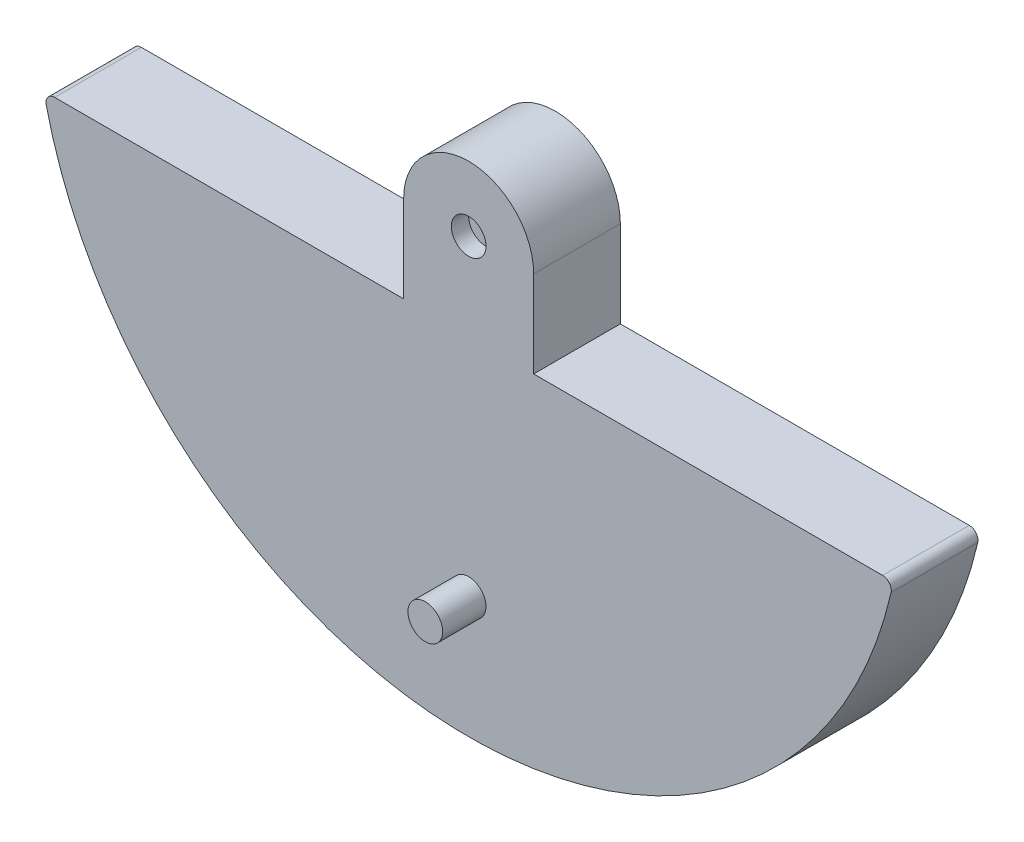
ISO-10303-21;
HEADER;
FILE_DESCRIPTION(('STEP AP214'),'2;1');
FILE_NAME('part.step','',(''),(''),'','','');
FILE_SCHEMA(('AUTOMOTIVE_DESIGN { 1 0 10303 214 1 1 1 1 }'));
ENDSEC;
DATA;
#1=APPLICATION_CONTEXT('core data for automotive mechanical design processes');
#2=APPLICATION_PROTOCOL_DEFINITION('international standard','automotive_design',2000,#1);
#3=PRODUCT_CONTEXT('',#1,'mechanical');
#4=PRODUCT('Part','Part','',(#3));
#5=PRODUCT_RELATED_PRODUCT_CATEGORY('part','',(#4));
#6=PRODUCT_DEFINITION_FORMATION('','',#4);
#7=PRODUCT_DEFINITION_CONTEXT('part definition',#1,'design');
#8=PRODUCT_DEFINITION('design','',#6,#7);
#9=PRODUCT_DEFINITION_SHAPE('','',#8);
#10=(LENGTH_UNIT() NAMED_UNIT(*) SI_UNIT(.MILLI.,.METRE.));
#11=(NAMED_UNIT(*) PLANE_ANGLE_UNIT() SI_UNIT($,.RADIAN.));
#12=(NAMED_UNIT(*) SI_UNIT($,.STERADIAN.) SOLID_ANGLE_UNIT());
#13=UNCERTAINTY_MEASURE_WITH_UNIT(LENGTH_MEASURE(1.E-05),#10,'distance_accuracy_value','');
#14=(GEOMETRIC_REPRESENTATION_CONTEXT(3) GLOBAL_UNCERTAINTY_ASSIGNED_CONTEXT((#13)) GLOBAL_UNIT_ASSIGNED_CONTEXT((#10,
#11,#12)) REPRESENTATION_CONTEXT('',''));
#15=CARTESIAN_POINT('',(0.,0.,0.));
#16=DIRECTION('',(0.,0.,1.));
#17=DIRECTION('',(1.,0.,0.));
#18=AXIS2_PLACEMENT_3D('',#15,#16,#17);
#19=CARTESIAN_POINT('',(0.,-180.,75.));
#20=DIRECTION('',(0.,0.,-1.));
#21=DIRECTION('',(-1.,0.,0.));
#22=AXIS2_PLACEMENT_3D('',#19,#20,#21);
#23=CYLINDRICAL_SURFACE('',#22,10.);
#24=CARTESIAN_POINT('',(0.,-180.,75.));
#25=DIRECTION('',(0.,0.,1.));
#26=DIRECTION('',(1.,0.,0.));
#27=AXIS2_PLACEMENT_3D('',#24,#25,#26);
#28=CIRCLE('',#27,10.);
#29=CARTESIAN_POINT('',(10.,-180.,75.));
#30=VERTEX_POINT('',#29);
#31=EDGE_CURVE('E11',#30,#30,#28,.T.);
#32=ORIENTED_EDGE('',*,*,#31,.F.);
#33=EDGE_LOOP('',(#32));
#34=FACE_BOUND('',#33,.T.);
#35=CARTESIAN_POINT('',(0.,-180.,50.));
#36=DIRECTION('',(0.,0.,1.));
#37=DIRECTION('',(1.,0.,0.));
#38=AXIS2_PLACEMENT_3D('',#35,#36,#37);
#39=CIRCLE('',#38,10.);
#40=CARTESIAN_POINT('',(10.,-180.,50.));
#41=VERTEX_POINT('',#40);
#42=EDGE_CURVE('E44',#41,#41,#39,.T.);
#43=ORIENTED_EDGE('',*,*,#42,.T.);
#44=EDGE_LOOP('',(#43));
#45=FACE_BOUND('',#44,.T.);
#46=ADVANCED_FACE('F41',(#34,#45),#23,.T.);
#47=CARTESIAN_POINT('',(0.,-180.,75.));
#48=DIRECTION('',(0.,0.,1.));
#49=DIRECTION('',(1.,0.,0.));
#50=AXIS2_PLACEMENT_3D('',#47,#48,#49);
#51=PLANE('',#50);
#52=ORIENTED_EDGE('',*,*,#31,.T.);
#53=EDGE_LOOP('',(#52));
#54=FACE_BOUND('',#53,.T.);
#55=ADVANCED_FACE('F56',(#54),#51,.T.);
#56=CARTESIAN_POINT('',(0.,-180.,50.));
#57=DIRECTION('',(0.,0.,1.));
#58=DIRECTION('',(1.,0.,0.));
#59=AXIS2_PLACEMENT_3D('',#56,#57,#58);
#60=PLANE('',#59);
#61=ORIENTED_EDGE('',*,*,#42,.F.);
#62=EDGE_LOOP('',(#61));
#63=FACE_BOUND('',#62,.T.);
#64=ADVANCED_FACE('F54',(#63),#60,.F.);
#65=CLOSED_SHELL('',(#46,#55,#64));
#66=MANIFOLD_SOLID_BREP('B2',#65);
#67=CARTESIAN_POINT('',(0.,0.,50.));
#68=DIRECTION('',(0.,0.,-1.));
#69=DIRECTION('',(-1.,0.,0.));
#70=AXIS2_PLACEMENT_3D('',#67,#68,#69);
#71=CYLINDRICAL_SURFACE('',#70,37.5);
#72=CARTESIAN_POINT('',(0.,0.,0.));
#73=DIRECTION('',(0.,0.,1.));
#74=DIRECTION('',(1.,0.,0.));
#75=AXIS2_PLACEMENT_3D('',#72,#73,#74);
#76=CIRCLE('',#75,37.5);
#77=CARTESIAN_POINT('',(37.5,0.,0.));
#78=VERTEX_POINT('',#77);
#79=CARTESIAN_POINT('',(-37.5,0.,0.));
#80=VERTEX_POINT('',#79);
#81=EDGE_CURVE('E183',#78,#80,#76,.T.);
#82=ORIENTED_EDGE('',*,*,#81,.T.);
#83=DIRECTION('',(0.,0.,-1.));
#84=VECTOR('',#83,1.);
#85=CARTESIAN_POINT('',(-37.5,0.,50.));
#86=LINE('',#85,#84);
#87=CARTESIAN_POINT('',(-37.5,0.,50.));
#88=VERTEX_POINT('',#87);
#89=EDGE_CURVE('E191',#88,#80,#86,.T.);
#90=ORIENTED_EDGE('',*,*,#89,.F.);
#91=CARTESIAN_POINT('',(0.,0.,50.));
#92=DIRECTION('',(0.,0.,1.));
#93=DIRECTION('',(1.,0.,0.));
#94=AXIS2_PLACEMENT_3D('',#91,#92,#93);
#95=CIRCLE('',#94,37.5);
#96=CARTESIAN_POINT('',(37.5,0.,50.));
#97=VERTEX_POINT('',#96);
#98=EDGE_CURVE('E173',#97,#88,#95,.T.);
#99=ORIENTED_EDGE('',*,*,#98,.F.);
#100=DIRECTION('',(0.,0.,-1.));
#101=VECTOR('',#100,1.);
#102=CARTESIAN_POINT('',(37.5,0.,50.));
#103=LINE('',#102,#101);
#104=EDGE_CURVE('E177',#97,#78,#103,.T.);
#105=ORIENTED_EDGE('',*,*,#104,.T.);
#106=EDGE_LOOP('',(#82,#90,#99,#105));
#107=FACE_BOUND('',#106,.T.);
#108=ADVANCED_FACE('F82',(#107),#71,.T.);
#109=CARTESIAN_POINT('',(-37.5,0.,50.));
#110=DIRECTION('',(1.,0.,0.));
#111=DIRECTION('',(0.,1.,0.));
#112=AXIS2_PLACEMENT_3D('',#109,#110,#111);
#113=PLANE('',#112);
#114=DIRECTION('',(0.,-1.,0.));
#115=VECTOR('',#114,1.);
#116=CARTESIAN_POINT('',(-37.5,0.,0.));
#117=LINE('',#116,#115);
#118=CARTESIAN_POINT('',(-37.5,-50.,0.));
#119=VERTEX_POINT('',#118);
#120=EDGE_CURVE('E165',#80,#119,#117,.T.);
#121=ORIENTED_EDGE('',*,*,#120,.T.);
#122=DIRECTION('',(0.,0.,1.));
#123=VECTOR('',#122,1.);
#124=CARTESIAN_POINT('',(-37.5,-50.,50.));
#125=LINE('',#124,#123);
#126=CARTESIAN_POINT('',(-37.5,-50.,50.));
#127=VERTEX_POINT('',#126);
#128=EDGE_CURVE('E152',#119,#127,#125,.T.);
#129=ORIENTED_EDGE('',*,*,#128,.T.);
#130=DIRECTION('',(0.,-1.,0.));
#131=VECTOR('',#130,1.);
#132=CARTESIAN_POINT('',(-37.5,0.,50.));
#133=LINE('',#132,#131);
#134=EDGE_CURVE('E163',#88,#127,#133,.T.);
#135=ORIENTED_EDGE('',*,*,#134,.F.);
#136=ORIENTED_EDGE('',*,*,#89,.T.);
#137=EDGE_LOOP('',(#121,#129,#135,#136));
#138=FACE_BOUND('',#137,.T.);
#139=ADVANCED_FACE('F161',(#138),#113,.F.);
#140=CARTESIAN_POINT('',(37.5,-100.,50.));
#141=DIRECTION('',(-1.,0.,0.));
#142=DIRECTION('',(0.,-1.,0.));
#143=AXIS2_PLACEMENT_3D('',#140,#141,#142);
#144=PLANE('',#143);
#145=DIRECTION('',(0.,1.,0.));
#146=VECTOR('',#145,1.);
#147=CARTESIAN_POINT('',(37.5,-100.,50.));
#148=LINE('',#147,#146);
#149=CARTESIAN_POINT('',(37.5,-50.,50.));
#150=VERTEX_POINT('',#149);
#151=EDGE_CURVE('E175',#150,#97,#148,.T.);
#152=ORIENTED_EDGE('',*,*,#151,.F.);
#153=DIRECTION('',(0.,0.,-1.));
#154=VECTOR('',#153,1.);
#155=CARTESIAN_POINT('',(37.5,-50.,50.));
#156=LINE('',#155,#154);
#157=CARTESIAN_POINT('',(37.5,-50.,0.));
#158=VERTEX_POINT('',#157);
#159=EDGE_CURVE('E167',#150,#158,#156,.T.);
#160=ORIENTED_EDGE('',*,*,#159,.T.);
#161=DIRECTION('',(0.,1.,0.));
#162=VECTOR('',#161,1.);
#163=CARTESIAN_POINT('',(37.5,-100.,0.));
#164=LINE('',#163,#162);
#165=EDGE_CURVE('E179',#158,#78,#164,.T.);
#166=ORIENTED_EDGE('',*,*,#165,.T.);
#167=ORIENTED_EDGE('',*,*,#104,.F.);
#168=EDGE_LOOP('',(#152,#160,#166,#167));
#169=FACE_BOUND('',#168,.T.);
#170=ADVANCED_FACE('F232',(#169),#144,.F.);
#171=CARTESIAN_POINT('',(0.,0.,50.));
#172=DIRECTION('',(0.,0.,1.));
#173=DIRECTION('',(1.,0.,0.));
#174=AXIS2_PLACEMENT_3D('',#171,#172,#173);
#175=PLANE('',#174);
#176=CARTESIAN_POINT('',(0.,0.,50.));
#177=DIRECTION('',(0.,0.,1.));
#178=DIRECTION('',(1.,0.,0.));
#179=AXIS2_PLACEMENT_3D('',#176,#177,#178);
#180=CIRCLE('',#179,250.);
#181=CARTESIAN_POINT('',(-243.619109924762,-56.1224489795919,50.));
#182=VERTEX_POINT('',#181);
#183=CARTESIAN_POINT('',(243.619109924762,-56.1224489795919,50.));
#184=VERTEX_POINT('',#183);
#185=EDGE_CURVE('E157',#182,#184,#180,.T.);
#186=ORIENTED_EDGE('',*,*,#185,.T.);
#187=CARTESIAN_POINT('',(238.746727726266,-55.,50.));
#188=DIRECTION('',(0.,0.,1.));
#189=DIRECTION('',(1.,0.,0.));
#190=AXIS2_PLACEMENT_3D('',#187,#188,#189);
#191=CIRCLE('',#190,5.);
#192=CARTESIAN_POINT('',(238.746727726266,-50.,50.));
#193=VERTEX_POINT('',#192);
#194=EDGE_CURVE('E200',#184,#193,#191,.T.);
#195=ORIENTED_EDGE('',*,*,#194,.T.);
#196=DIRECTION('',(-1.,0.,0.));
#197=VECTOR('',#196,1.);
#198=CARTESIAN_POINT('',(-244.948974278318,-50.,50.));
#199=LINE('',#198,#197);
#200=EDGE_CURVE('E156',#193,#150,#199,.T.);
#201=ORIENTED_EDGE('',*,*,#200,.T.);
#202=ORIENTED_EDGE('',*,*,#151,.T.);
#203=ORIENTED_EDGE('',*,*,#98,.T.);
#204=ORIENTED_EDGE('',*,*,#134,.T.);
#205=CARTESIAN_POINT('',(-238.746727726266,-50.,50.));
#206=VERTEX_POINT('',#205);
#207=EDGE_CURVE('E149',#127,#206,#199,.T.);
#208=ORIENTED_EDGE('',*,*,#207,.T.);
#209=CARTESIAN_POINT('',(-238.746727726266,-55.,50.));
#210=DIRECTION('',(0.,0.,1.));
#211=DIRECTION('',(1.,0.,0.));
#212=AXIS2_PLACEMENT_3D('',#209,#210,#211);
#213=CIRCLE('',#212,5.);
#214=EDGE_CURVE('E198',#206,#182,#213,.T.);
#215=ORIENTED_EDGE('',*,*,#214,.T.);
#216=EDGE_LOOP('',(#186,#195,#201,#202,#203,#204,#208,#215));
#217=FACE_BOUND('',#216,.T.);
#218=CARTESIAN_POINT('',(0.,0.,50.));
#219=DIRECTION('',(0.,0.,1.));
#220=DIRECTION('',(1.,0.,0.));
#221=AXIS2_PLACEMENT_3D('',#218,#219,#220);
#222=CIRCLE('',#221,10.);
#223=CARTESIAN_POINT('',(10.,0.,50.));
#224=VERTEX_POINT('',#223);
#225=EDGE_CURVE('E166',#224,#224,#222,.T.);
#226=ORIENTED_EDGE('',*,*,#225,.F.);
#227=EDGE_LOOP('',(#226));
#228=FACE_BOUND('',#227,.T.);
#229=ADVANCED_FACE('F170',(#217,#228),#175,.T.);
#230=CARTESIAN_POINT('',(0.,0.,0.));
#231=DIRECTION('',(0.,0.,1.));
#232=DIRECTION('',(1.,0.,0.));
#233=AXIS2_PLACEMENT_3D('',#230,#231,#232);
#234=PLANE('',#233);
#235=DIRECTION('',(-1.,0.,0.));
#236=VECTOR('',#235,1.);
#237=CARTESIAN_POINT('',(-244.948974278318,-50.,0.));
#238=LINE('',#237,#236);
#239=CARTESIAN_POINT('',(238.746727726266,-50.,0.));
#240=VERTEX_POINT('',#239);
#241=EDGE_CURVE('E208',#240,#158,#238,.T.);
#242=ORIENTED_EDGE('',*,*,#241,.F.);
#243=CARTESIAN_POINT('',(238.746727726266,-55.,0.));
#244=DIRECTION('',(0.,0.,1.));
#245=DIRECTION('',(1.,0.,0.));
#246=AXIS2_PLACEMENT_3D('',#243,#244,#245);
#247=CIRCLE('',#246,5.);
#248=CARTESIAN_POINT('',(243.619109924762,-56.1224489795919,0.));
#249=VERTEX_POINT('',#248);
#250=EDGE_CURVE('E90',#240,#249,#247,.F.);
#251=ORIENTED_EDGE('',*,*,#250,.T.);
#252=CARTESIAN_POINT('',(0.,0.,0.));
#253=DIRECTION('',(0.,0.,1.));
#254=DIRECTION('',(1.,0.,0.));
#255=AXIS2_PLACEMENT_3D('',#252,#253,#254);
#256=CIRCLE('',#255,250.);
#257=CARTESIAN_POINT('',(-243.619109924762,-56.1224489795919,0.));
#258=VERTEX_POINT('',#257);
#259=EDGE_CURVE('E206',#258,#249,#256,.T.);
#260=ORIENTED_EDGE('',*,*,#259,.F.);
#261=CARTESIAN_POINT('',(-238.746727726266,-55.,0.));
#262=DIRECTION('',(0.,0.,1.));
#263=DIRECTION('',(1.,0.,0.));
#264=AXIS2_PLACEMENT_3D('',#261,#262,#263);
#265=CIRCLE('',#264,5.);
#266=CARTESIAN_POINT('',(-238.746727726266,-50.,0.));
#267=VERTEX_POINT('',#266);
#268=EDGE_CURVE('E97',#258,#267,#265,.F.);
#269=ORIENTED_EDGE('',*,*,#268,.T.);
#270=EDGE_CURVE('E215',#119,#267,#238,.T.);
#271=ORIENTED_EDGE('',*,*,#270,.F.);
#272=ORIENTED_EDGE('',*,*,#120,.F.);
#273=ORIENTED_EDGE('',*,*,#81,.F.);
#274=ORIENTED_EDGE('',*,*,#165,.F.);
#275=EDGE_LOOP('',(#242,#251,#260,#269,#271,#272,#273,#274));
#276=FACE_BOUND('',#275,.T.);
#277=ADVANCED_FACE('F205',(#276),#234,.F.);
#278=CARTESIAN_POINT('',(0.,0.,40.));
#279=DIRECTION('',(0.,0.,1.));
#280=DIRECTION('',(1.,0.,0.));
#281=AXIS2_PLACEMENT_3D('',#278,#279,#280);
#282=CYLINDRICAL_SURFACE('',#281,10.);
#283=CARTESIAN_POINT('',(0.,0.,40.));
#284=DIRECTION('',(0.,0.,1.));
#285=DIRECTION('',(1.,0.,0.));
#286=AXIS2_PLACEMENT_3D('',#283,#284,#285);
#287=CIRCLE('',#286,10.);
#288=CARTESIAN_POINT('',(10.,0.,40.));
#289=VERTEX_POINT('',#288);
#290=EDGE_CURVE('E186',#289,#289,#287,.T.);
#291=ORIENTED_EDGE('',*,*,#290,.F.);
#292=EDGE_LOOP('',(#291));
#293=FACE_BOUND('',#292,.T.);
#294=ORIENTED_EDGE('',*,*,#225,.T.);
#295=EDGE_LOOP('',(#294));
#296=FACE_BOUND('',#295,.T.);
#297=ADVANCED_FACE('F230',(#293,#296),#282,.F.);
#298=CARTESIAN_POINT('',(0.,0.,40.));
#299=DIRECTION('',(0.,0.,1.));
#300=DIRECTION('',(1.,0.,0.));
#301=AXIS2_PLACEMENT_3D('',#298,#299,#300);
#302=PLANE('',#301);
#303=ORIENTED_EDGE('',*,*,#290,.T.);
#304=EDGE_LOOP('',(#303));
#305=FACE_BOUND('',#304,.T.);
#306=ADVANCED_FACE('F261',(#305),#302,.T.);
#307=CARTESIAN_POINT('',(-244.948974278318,-50.,0.));
#308=DIRECTION('',(0.,1.,0.));
#309=DIRECTION('',(0.,0.,1.));
#310=AXIS2_PLACEMENT_3D('',#307,#308,#309);
#311=PLANE('',#310);
#312=ORIENTED_EDGE('',*,*,#270,.T.);
#313=DIRECTION('',(0.,0.,1.));
#314=VECTOR('',#313,1.);
#315=CARTESIAN_POINT('',(-238.746727726266,-50.,0.));
#316=LINE('',#315,#314);
#317=EDGE_CURVE('E39',#267,#206,#316,.T.);
#318=ORIENTED_EDGE('',*,*,#317,.T.);
#319=ORIENTED_EDGE('',*,*,#207,.F.);
#320=ORIENTED_EDGE('',*,*,#128,.F.);
#321=EDGE_LOOP('',(#312,#318,#319,#320));
#322=FACE_BOUND('',#321,.T.);
#323=ADVANCED_FACE('F151',(#322),#311,.T.);
#324=ORIENTED_EDGE('',*,*,#200,.F.);
#325=DIRECTION('',(0.,0.,1.));
#326=VECTOR('',#325,1.);
#327=CARTESIAN_POINT('',(238.746727726266,-50.,0.));
#328=LINE('',#327,#326);
#329=EDGE_CURVE('E105',#193,#240,#328,.F.);
#330=ORIENTED_EDGE('',*,*,#329,.T.);
#331=ORIENTED_EDGE('',*,*,#241,.T.);
#332=ORIENTED_EDGE('',*,*,#159,.F.);
#333=EDGE_LOOP('',(#324,#330,#331,#332));
#334=FACE_BOUND('',#333,.T.);
#335=ADVANCED_FACE('F219',(#334),#311,.T.);
#336=CARTESIAN_POINT('',(0.,0.,0.));
#337=DIRECTION('',(0.,0.,1.));
#338=DIRECTION('',(1.,0.,0.));
#339=AXIS2_PLACEMENT_3D('',#336,#337,#338);
#340=CYLINDRICAL_SURFACE('',#339,250.);
#341=ORIENTED_EDGE('',*,*,#259,.T.);
#342=DIRECTION('',(0.,0.,1.));
#343=VECTOR('',#342,1.);
#344=CARTESIAN_POINT('',(243.619109924762,-56.1224489795919,0.));
#345=LINE('',#344,#343);
#346=EDGE_CURVE('E195',#249,#184,#345,.T.);
#347=ORIENTED_EDGE('',*,*,#346,.T.);
#348=ORIENTED_EDGE('',*,*,#185,.F.);
#349=DIRECTION('',(0.,0.,1.));
#350=VECTOR('',#349,1.);
#351=CARTESIAN_POINT('',(-243.619109924762,-56.1224489795919,0.));
#352=LINE('',#351,#350);
#353=EDGE_CURVE('E193',#182,#258,#352,.F.);
#354=ORIENTED_EDGE('',*,*,#353,.T.);
#355=EDGE_LOOP('',(#341,#347,#348,#354));
#356=FACE_BOUND('',#355,.T.);
#357=ADVANCED_FACE('F212',(#356),#340,.T.);
#358=CARTESIAN_POINT('',(238.746727726266,-55.,0.));
#359=DIRECTION('',(0.,0.,1.));
#360=DIRECTION('',(1.,0.,0.));
#361=AXIS2_PLACEMENT_3D('',#358,#359,#360);
#362=CYLINDRICAL_SURFACE('',#361,5.);
#363=ORIENTED_EDGE('',*,*,#250,.F.);
#364=ORIENTED_EDGE('',*,*,#329,.F.);
#365=ORIENTED_EDGE('',*,*,#194,.F.);
#366=ORIENTED_EDGE('',*,*,#346,.F.);
#367=EDGE_LOOP('',(#363,#364,#365,#366));
#368=FACE_BOUND('',#367,.T.);
#369=ADVANCED_FACE('F217',(#368),#362,.T.);
#370=CARTESIAN_POINT('',(-238.746727726266,-55.,0.));
#371=DIRECTION('',(0.,0.,1.));
#372=DIRECTION('',(1.,0.,0.));
#373=AXIS2_PLACEMENT_3D('',#370,#371,#372);
#374=CYLINDRICAL_SURFACE('',#373,5.);
#375=ORIENTED_EDGE('',*,*,#268,.F.);
#376=ORIENTED_EDGE('',*,*,#353,.F.);
#377=ORIENTED_EDGE('',*,*,#214,.F.);
#378=ORIENTED_EDGE('',*,*,#317,.F.);
#379=EDGE_LOOP('',(#375,#376,#377,#378));
#380=FACE_BOUND('',#379,.T.);
#381=ADVANCED_FACE('F84',(#380),#374,.T.);
#382=CLOSED_SHELL('',(#108,#139,#170,#229,#277,#297,#306,#323,#335,#357,#369,#381));
#383=MANIFOLD_SOLID_BREP('B6',#382);
#384=ADVANCED_BREP_SHAPE_REPRESENTATION('',(#18,#66,#383),#14);
#385=SHAPE_DEFINITION_REPRESENTATION(#9,#384);
ENDSEC;
END-ISO-10303-21;
